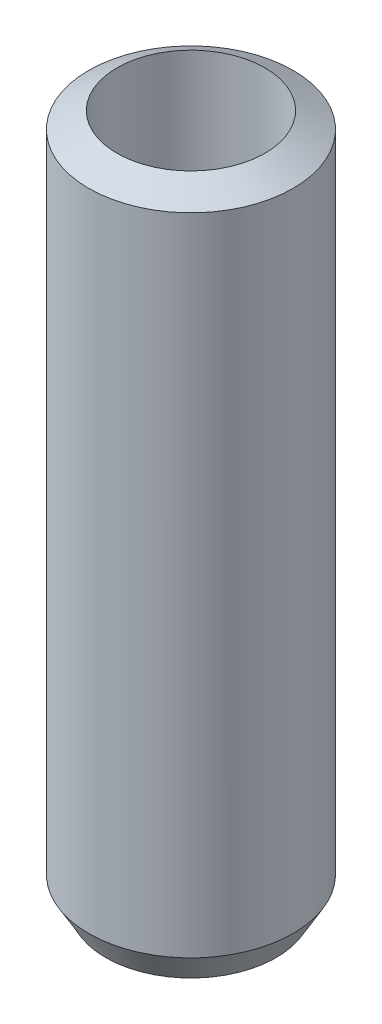
ISO-10303-21;
HEADER;
FILE_DESCRIPTION(('STEP AP214'),'2;1');
FILE_NAME('part.step','',(''),(''),'','','');
FILE_SCHEMA(('AUTOMOTIVE_DESIGN { 1 0 10303 214 1 1 1 1 }'));
ENDSEC;
DATA;
#1=APPLICATION_CONTEXT('core data for automotive mechanical design processes');
#2=APPLICATION_PROTOCOL_DEFINITION('international standard','automotive_design',2000,#1);
#3=PRODUCT_CONTEXT('',#1,'mechanical');
#4=PRODUCT('Part','Part','',(#3));
#5=PRODUCT_RELATED_PRODUCT_CATEGORY('part','',(#4));
#6=PRODUCT_DEFINITION_FORMATION('','',#4);
#7=PRODUCT_DEFINITION_CONTEXT('part definition',#1,'design');
#8=PRODUCT_DEFINITION('design','',#6,#7);
#9=PRODUCT_DEFINITION_SHAPE('','',#8);
#10=(LENGTH_UNIT() NAMED_UNIT(*) SI_UNIT(.MILLI.,.METRE.));
#11=(NAMED_UNIT(*) PLANE_ANGLE_UNIT() SI_UNIT($,.RADIAN.));
#12=(NAMED_UNIT(*) SI_UNIT($,.STERADIAN.) SOLID_ANGLE_UNIT());
#13=UNCERTAINTY_MEASURE_WITH_UNIT(LENGTH_MEASURE(1.E-05),#10,'distance_accuracy_value','');
#14=(GEOMETRIC_REPRESENTATION_CONTEXT(3) GLOBAL_UNCERTAINTY_ASSIGNED_CONTEXT((#13)) GLOBAL_UNIT_ASSIGNED_CONTEXT((#10,
#11,#12)) REPRESENTATION_CONTEXT('',''));
#15=CARTESIAN_POINT('',(0.,0.,0.));
#16=DIRECTION('',(0.,0.,1.));
#17=DIRECTION('',(1.,0.,0.));
#18=AXIS2_PLACEMENT_3D('',#15,#16,#17);
#19=CARTESIAN_POINT('',(0.,202.993195611035,0.));
#20=DIRECTION('',(0.,-1.,0.));
#21=DIRECTION('',(0.,0.,-1.));
#22=AXIS2_PLACEMENT_3D('',#19,#20,#21);
#23=CYLINDRICAL_SURFACE('',#22,30.);
#24=CARTESIAN_POINT('',(0.,198.004105193602,0.));
#25=DIRECTION('',(0.,1.,0.));
#26=DIRECTION('',(0.,0.,1.));
#27=AXIS2_PLACEMENT_3D('',#24,#25,#26);
#28=CIRCLE('',#27,30.);
#29=CARTESIAN_POINT('',(0.,198.004105193602,30.));
#30=VERTEX_POINT('',#29);
#31=EDGE_CURVE('E50',#30,#30,#28,.F.);
#32=ORIENTED_EDGE('',*,*,#31,.T.);
#33=EDGE_LOOP('',(#32));
#34=FACE_BOUND('',#33,.T.);
#35=CARTESIAN_POINT('',(0.,8.64135808654781,0.));
#36=DIRECTION('',(0.,1.,0.));
#37=DIRECTION('',(0.,0.,1.));
#38=AXIS2_PLACEMENT_3D('',#35,#36,#37);
#39=CIRCLE('',#38,30.);
#40=CARTESIAN_POINT('',(0.,8.64135808654781,30.));
#41=VERTEX_POINT('',#40);
#42=EDGE_CURVE('E51',#41,#41,#39,.T.);
#43=ORIENTED_EDGE('',*,*,#42,.T.);
#44=EDGE_LOOP('',(#43));
#45=FACE_BOUND('',#44,.T.);
#46=ADVANCED_FACE('F39',(#34,#45),#23,.T.);
#47=CARTESIAN_POINT('',(0.,0.,0.));
#48=DIRECTION('',(0.,1.,0.));
#49=DIRECTION('',(0.,0.,1.));
#50=AXIS2_PLACEMENT_3D('',#47,#48,#49);
#51=PLANE('',#50);
#52=CARTESIAN_POINT('',(0.,0.,0.));
#53=DIRECTION('',(0.,1.,0.));
#54=DIRECTION('',(0.,0.,1.));
#55=AXIS2_PLACEMENT_3D('',#52,#53,#54);
#56=CIRCLE('',#55,25.0109095825676);
#57=CARTESIAN_POINT('',(0.,0.,25.0109095825676));
#58=VERTEX_POINT('',#57);
#59=EDGE_CURVE('E10',#58,#58,#56,.F.);
#60=ORIENTED_EDGE('',*,*,#59,.T.);
#61=EDGE_LOOP('',(#60));
#62=FACE_BOUND('',#61,.T.);
#63=CARTESIAN_POINT('',(0.,0.,0.));
#64=DIRECTION('',(0.,1.,0.));
#65=DIRECTION('',(0.,0.,1.));
#66=AXIS2_PLACEMENT_3D('',#63,#64,#65);
#67=CIRCLE('',#66,21.7207904644799);
#68=CARTESIAN_POINT('',(0.,0.,21.7207904644799));
#69=VERTEX_POINT('',#68);
#70=EDGE_CURVE('E58',#69,#69,#67,.T.);
#71=ORIENTED_EDGE('',*,*,#70,.T.);
#72=EDGE_LOOP('',(#71));
#73=FACE_BOUND('',#72,.T.);
#74=ADVANCED_FACE('F62',(#62,#73),#51,.F.);
#75=CARTESIAN_POINT('',(0.,202.993195611035,0.));
#76=DIRECTION('',(0.,-1.,0.));
#77=DIRECTION('',(0.,0.,-1.));
#78=AXIS2_PLACEMENT_3D('',#75,#76,#77);
#79=CYLINDRICAL_SURFACE('',#78,21.7207904644799);
#80=CARTESIAN_POINT('',(0.,202.784109047612,0.));
#81=DIRECTION('',(0.,-1.,0.));
#82=DIRECTION('',(0.,0.,-1.));
#83=AXIS2_PLACEMENT_3D('',#80,#81,#82);
#84=CIRCLE('',#83,21.7207904644799);
#85=CARTESIAN_POINT('',(0.,202.784109047612,-21.7207904644799));
#86=VERTEX_POINT('',#85);
#87=EDGE_CURVE('E54',#86,#86,#84,.F.);
#88=ORIENTED_EDGE('',*,*,#87,.T.);
#89=EDGE_LOOP('',(#88));
#90=FACE_BOUND('',#89,.T.);
#91=ORIENTED_EDGE('',*,*,#70,.F.);
#92=EDGE_LOOP('',(#91));
#93=FACE_BOUND('',#92,.T.);
#94=ADVANCED_FACE('F68',(#90,#93),#79,.F.);
#95=CARTESIAN_POINT('',(0.,202.993195611035,0.));
#96=DIRECTION('',(0.,-1.,0.));
#97=DIRECTION('',(0.,0.,-1.));
#98=AXIS2_PLACEMENT_3D('',#95,#96,#97);
#99=CONICAL_SURFACE('',#98,21.358641913452,1.0471975511966);
#100=ORIENTED_EDGE('',*,*,#31,.F.);
#101=EDGE_LOOP('',(#100));
#102=FACE_BOUND('',#101,.T.);
#103=ORIENTED_EDGE('',*,*,#87,.F.);
#104=EDGE_LOOP('',(#103));
#105=FACE_BOUND('',#104,.T.);
#106=ADVANCED_FACE('F66',(#102,#105),#99,.T.);
#107=CARTESIAN_POINT('',(0.,8.64135808654781,0.));
#108=DIRECTION('',(0.,1.,0.));
#109=DIRECTION('',(0.,0.,1.));
#110=AXIS2_PLACEMENT_3D('',#107,#108,#109);
#111=CONICAL_SURFACE('',#110,30.,0.523598775598302);
#112=ORIENTED_EDGE('',*,*,#59,.F.);
#113=EDGE_LOOP('',(#112));
#114=FACE_BOUND('',#113,.T.);
#115=ORIENTED_EDGE('',*,*,#42,.F.);
#116=EDGE_LOOP('',(#115));
#117=FACE_BOUND('',#116,.T.);
#118=ADVANCED_FACE('F45',(#114,#117),#111,.T.);
#119=CLOSED_SHELL('',(#46,#74,#94,#106,#118));
#120=MANIFOLD_SOLID_BREP('B2',#119);
#121=ADVANCED_BREP_SHAPE_REPRESENTATION('',(#18,#120),#14);
#122=SHAPE_DEFINITION_REPRESENTATION(#9,#121);
ENDSEC;
END-ISO-10303-21;
